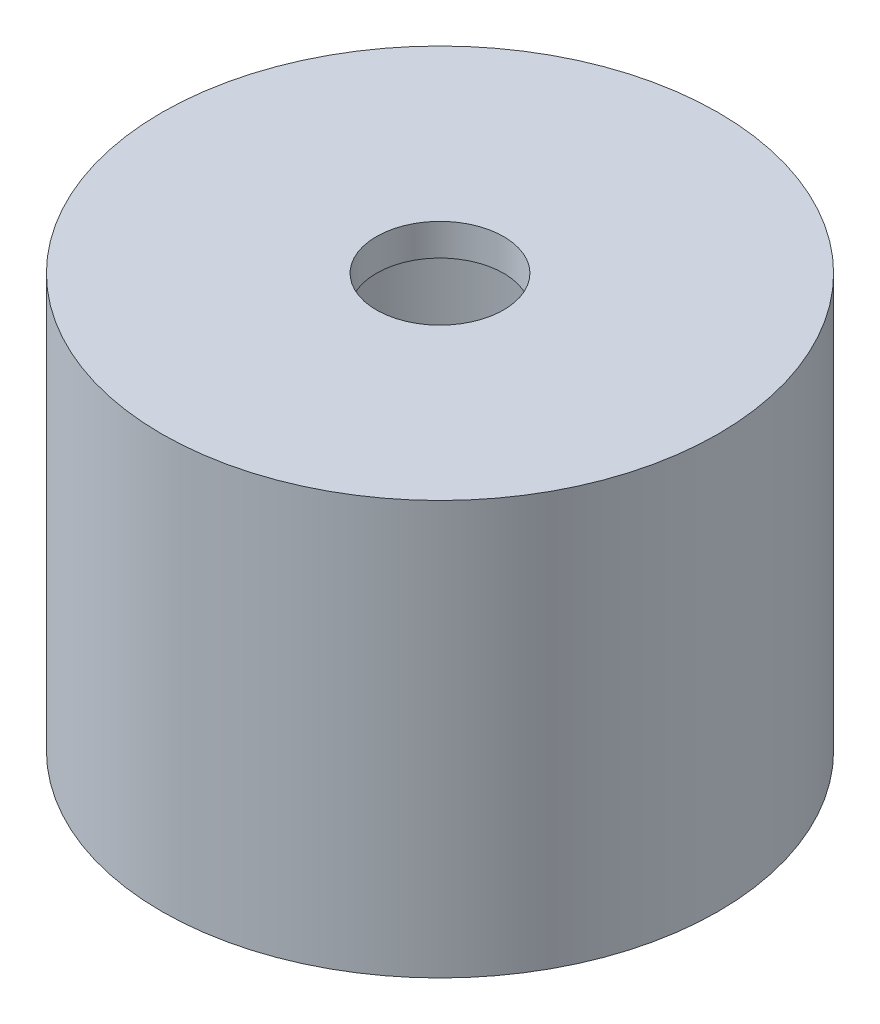
ISO-10303-21;
HEADER;
FILE_DESCRIPTION(('STEP AP214'),'2;1');
FILE_NAME('part.step','',(''),(''),'','','');
FILE_SCHEMA(('AUTOMOTIVE_DESIGN { 1 0 10303 214 1 1 1 1 }'));
ENDSEC;
DATA;
#1=APPLICATION_CONTEXT('core data for automotive mechanical design processes');
#2=APPLICATION_PROTOCOL_DEFINITION('international standard','automotive_design',2000,#1);
#3=PRODUCT_CONTEXT('',#1,'mechanical');
#4=PRODUCT('Part','Part','',(#3));
#5=PRODUCT_RELATED_PRODUCT_CATEGORY('part','',(#4));
#6=PRODUCT_DEFINITION_FORMATION('','',#4);
#7=PRODUCT_DEFINITION_CONTEXT('part definition',#1,'design');
#8=PRODUCT_DEFINITION('design','',#6,#7);
#9=PRODUCT_DEFINITION_SHAPE('','',#8);
#10=(LENGTH_UNIT() NAMED_UNIT(*) SI_UNIT(.MILLI.,.METRE.));
#11=(NAMED_UNIT(*) PLANE_ANGLE_UNIT() SI_UNIT($,.RADIAN.));
#12=(NAMED_UNIT(*) SI_UNIT($,.STERADIAN.) SOLID_ANGLE_UNIT());
#13=UNCERTAINTY_MEASURE_WITH_UNIT(LENGTH_MEASURE(1.E-05),#10,'distance_accuracy_value','');
#14=(GEOMETRIC_REPRESENTATION_CONTEXT(3) GLOBAL_UNCERTAINTY_ASSIGNED_CONTEXT((#13)) GLOBAL_UNIT_ASSIGNED_CONTEXT((#10,
#11,#12)) REPRESENTATION_CONTEXT('',''));
#15=CARTESIAN_POINT('',(0.,0.,0.));
#16=DIRECTION('',(0.,0.,1.));
#17=DIRECTION('',(1.,0.,0.));
#18=AXIS2_PLACEMENT_3D('',#15,#16,#17);
#19=CARTESIAN_POINT('',(0.,0.,0.));
#20=DIRECTION('',(0.,1.,0.));
#21=DIRECTION('',(-1.,0.,0.));
#22=AXIS2_PLACEMENT_3D('',#19,#20,#21);
#23=CYLINDRICAL_SURFACE('',#22,17.5);
#24=CARTESIAN_POINT('',(-17.3853386507137,-13.5,-2.));
#25=CARTESIAN_POINT('',(-17.3853401353315,-13.3880534106275,-1.99999519733595));
#26=CARTESIAN_POINT('',(-17.3864315751054,-13.2760350050781,-1.99056928251642));
#27=CARTESIAN_POINT('',(-17.3906782331753,-13.0551103283025,-1.95311344773096));
#28=CARTESIAN_POINT('',(-17.3938356616542,-12.946207520496,-1.92506360351944));
#29=CARTESIAN_POINT('',(-17.4018520931882,-12.7347449697205,-1.85119296589626));
#30=CARTESIAN_POINT('',(-17.4067099973959,-12.6321811807144,-1.80538364660709));
#31=CARTESIAN_POINT('',(-17.4175786814491,-12.4362179339541,-1.6973178849601));
#32=CARTESIAN_POINT('',(-17.423589249671,-12.3428167987322,-1.6350644608687));
#33=CARTESIAN_POINT('',(-17.4361176819346,-12.1673704362883,-1.49556368835386));
#34=CARTESIAN_POINT('',(-17.4426375676046,-12.0853744720842,-1.41825455823809));
#35=CARTESIAN_POINT('',(-17.4554317583341,-11.9354909775062,-1.25096954824277));
#36=CARTESIAN_POINT('',(-17.4617060516193,-11.8676041228942,-1.16099306200071));
#37=CARTESIAN_POINT('',(-17.4733225280882,-11.7476917594087,-0.970620910263634));
#38=CARTESIAN_POINT('',(-17.4786620969871,-11.6957104419626,-0.870197236204717));
#39=CARTESIAN_POINT('',(-17.4877853680334,-11.6093675939413,-0.661974973209919));
#40=CARTESIAN_POINT('',(-17.4915691188697,-11.5750055119674,-0.554176615186414));
#41=CARTESIAN_POINT('',(-17.4971402074226,-11.5250226574715,-0.334766558288023));
#42=CARTESIAN_POINT('',(-17.4989362281041,-11.5093203514256,-0.223173657194598));
#43=CARTESIAN_POINT('',(-17.5003590938998,-11.4968502785792,0.00107691382555918));
#44=CARTESIAN_POINT('',(-17.4999860111176,-11.5000818823936,0.11373454823503));
#45=CARTESIAN_POINT('',(-17.497119767547,-11.5253221727227,0.33636248784968));
#46=CARTESIAN_POINT('',(-17.4946365066491,-11.5472431795839,0.44634287900327));
#47=CARTESIAN_POINT('',(-17.487840154992,-11.6091031704963,0.661053445479786));
#48=CARTESIAN_POINT('',(-17.4835270343592,-11.6490424487068,0.765783535057301));
#49=CARTESIAN_POINT('',(-17.4735386514763,-11.7458998090241,0.967294288035754));
#50=CARTESIAN_POINT('',(-17.4678603196472,-11.8028562239929,1.06405636819045));
#51=CARTESIAN_POINT('',(-17.4557776619181,-11.9321032155566,1.24668163917683));
#52=CARTESIAN_POINT('',(-17.449373308183,-12.0043943801677,1.33254441186903));
#53=CARTESIAN_POINT('',(-17.436513040988,-12.1627508055122,1.49144815236604));
#54=CARTESIAN_POINT('',(-17.4300570420279,-12.2488924178999,1.56441304576845));
#55=CARTESIAN_POINT('',(-17.4178574111694,-12.4322411076691,1.69485961446738));
#56=CARTESIAN_POINT('',(-17.4121137808956,-12.5294482102849,1.75234125445402));
#57=CARTESIAN_POINT('',(-17.4019890438088,-12.7322320602566,1.85019181534949));
#58=CARTESIAN_POINT('',(-17.3976083716403,-12.8378114640803,1.89055527879404));
#59=CARTESIAN_POINT('',(-17.3907142897617,-13.0543105765331,1.95295957446188));
#60=CARTESIAN_POINT('',(-17.3882008052541,-13.165230071055,1.97500114064275));
#61=CARTESIAN_POINT('',(-17.3853390699854,-13.388590723993,2.00003653434785));
#62=CARTESIAN_POINT('',(-17.384978682311,-13.501019765499,2.00313713351255));
#63=CARTESIAN_POINT('',(-17.3864318824203,-13.724795725912,1.99048370024868));
#64=CARTESIAN_POINT('',(-17.3882454316329,-13.8361426639828,1.97473000234356));
#65=CARTESIAN_POINT('',(-17.3938311078367,-14.0542777104319,1.92490480743124));
#66=CARTESIAN_POINT('',(-17.3975977651037,-14.1610776535572,1.89088445720912));
#67=CARTESIAN_POINT('',(-17.4066608217964,-14.3674562088561,1.8055441206904));
#68=CARTESIAN_POINT('',(-17.4119572665405,-14.4670346069898,1.75422362188829));
#69=CARTESIAN_POINT('',(-17.4235123453982,-14.6566281200632,1.63547501760195));
#70=CARTESIAN_POINT('',(-17.4297751382952,-14.7465989128562,1.5679765587049));
#71=CARTESIAN_POINT('',(-17.442543959092,-14.9139723082586,1.41888814821184));
#72=CARTESIAN_POINT('',(-17.4490499948718,-14.991374503276,1.33729773979956));
#73=CARTESIAN_POINT('',(-17.4616092377758,-15.1317854831745,1.16187651855541));
#74=CARTESIAN_POINT('',(-17.4676601534551,-15.1947243377017,1.06798954470542));
#75=CARTESIAN_POINT('',(-17.4785935486018,-15.3039393791936,0.870915351390361));
#76=CARTESIAN_POINT('',(-17.4834760482544,-15.3502158540187,0.767728292632569));
#77=CARTESIAN_POINT('',(-17.4915122431867,-15.4246756612399,0.555220730050709));
#78=CARTESIAN_POINT('',(-17.4946698766728,-15.4529002350619,0.445914831710693));
#79=CARTESIAN_POINT('',(-17.498916830849,-15.4905894195193,0.224077216219367));
#80=CARTESIAN_POINT('',(-17.5000062287579,-15.5000547305438,0.111545619660738));
#81=CARTESIAN_POINT('',(-17.4999937520126,-15.4999451025024,-0.112864401253134));
#82=CARTESIAN_POINT('',(-17.4989043247502,-15.4904783204506,-0.22474289469505));
#83=CARTESIAN_POINT('',(-17.4946812487719,-15.4530012713425,-0.445308378800854));
#84=CARTESIAN_POINT('',(-17.4915475999627,-15.4249910034401,-0.553995369319135));
#85=CARTESIAN_POINT('',(-17.4835868311737,-15.3512542852782,-0.765084431079246));
#86=CARTESIAN_POINT('',(-17.478760120486,-15.3055321165341,-0.867488014290727));
#87=CARTESIAN_POINT('',(-17.4679493137143,-15.1976807335209,-1.0631853726956));
#88=CARTESIAN_POINT('',(-17.4619652131149,-15.1355514552428,-1.15647911234695));
#89=CARTESIAN_POINT('',(-17.4494678477128,-14.9962464882111,-1.33186210611053));
#90=CARTESIAN_POINT('',(-17.4429518630308,-14.9189902181949,-1.41388716420689));
#91=CARTESIAN_POINT('',(-17.4301475365176,-14.7517890168144,-1.5638533009412));
#92=CARTESIAN_POINT('',(-17.4238592492669,-14.6618410681513,-1.63179102096622));
#93=CARTESIAN_POINT('',(-17.4122005213082,-14.4714803763493,-1.75183717616198));
#94=CARTESIAN_POINT('',(-17.4068331273112,-14.3710346006377,-1.80389349456594));
#95=CARTESIAN_POINT('',(-17.3976597913728,-14.1628256626319,-1.89032803888977));
#96=CARTESIAN_POINT('',(-17.3938521233529,-14.0550707438652,-1.92472581745879));
#97=CARTESIAN_POINT('',(-17.3891702575432,-13.8722778731211,-1.96647476380521));
#98=CARTESIAN_POINT('',(-17.3877403947785,-13.7984004548313,-1.9790290620281));
#99=CARTESIAN_POINT('',(-17.3858240977585,-13.6496927260883,-1.99579326119775));
#100=CARTESIAN_POINT('',(-17.3853376579002,-13.574862421297,-2.00000321170177));
#101=CARTESIAN_POINT('',(-17.3853386507137,-13.5,-2.));
#102=B_SPLINE_CURVE_WITH_KNOTS('',3,(#24,#25,#26,#27,#28,#29,#30,#31,#32,#33,#34,#35,#36,#37,
#38,#39,#40,#41,#42,#43,#44,#45,#46,#47,#48,#49,#50,#51,#52,#53,#54,#55,#56,#57,#58,#59,#60,#61,
#62,#63,#64,#65,#66,#67,#68,#69,#70,#71,#72,#73,#74,#75,#76,#77,#78,#79,#80,#81,#82,#83,#84,#85,
#86,#87,#88,#89,#90,#91,#92,#93,#94,#95,#96,#97,#98,#99,#100,#101),.UNSPECIFIED.,.T.,.F.,(4,2,2,
2,2,2,2,2,2,2,2,2,2,2,2,2,2,2,2,2,2,2,2,2,2,2,2,2,2,2,2,2,2,2,2,2,2,2,4),(0.,0.335566330669862,
0.671492236482426,1.00720146648589,1.34284912082551,1.67990430025881,2.01697561937899,
2.35497511648652,2.69296403516427,3.02947062308711,3.36596602520247,3.70089142156129,
4.03582228598058,4.3715133792636,4.70721734706225,5.04483970261994,5.3824628281258,
5.72019351085555,6.05791066376697,6.39372230997641,6.72952799811684,7.06439829362763,
7.3992785103225,7.73564232927687,8.07201705412561,8.40998545131677,8.74794800946722,
9.08513567305447,9.42231074728433,9.75756507912587,10.0928194262631,10.4279927825518,
10.7631674464669,11.1001786972192,11.4372702038874,11.7754563049136,12.113267132881,
12.3376728727777,12.5620772799195),.UNSPECIFIED.);
#103=CARTESIAN_POINT('',(-17.3853386507137,-13.5,-2.));
#104=VERTEX_POINT('',#103);
#105=EDGE_CURVE('E54',#104,#104,#102,.T.);
#106=ORIENTED_EDGE('',*,*,#105,.T.);
#107=EDGE_LOOP('',(#106));
#108=FACE_BOUND('',#107,.T.);
#109=CARTESIAN_POINT('',(0.,-21.,0.));
#110=DIRECTION('',(0.,1.,0.));
#111=DIRECTION('',(-1.,0.,0.));
#112=AXIS2_PLACEMENT_3D('',#109,#110,#111);
#113=CIRCLE('',#112,17.5);
#114=CARTESIAN_POINT('',(-17.5,-21.,0.));
#115=VERTEX_POINT('',#114);
#116=EDGE_CURVE('E10',#115,#115,#113,.T.);
#117=ORIENTED_EDGE('',*,*,#116,.T.);
#118=EDGE_LOOP('',(#117));
#119=FACE_BOUND('',#118,.T.);
#120=CARTESIAN_POINT('',(0.,4.99999999999999,0.));
#121=DIRECTION('',(0.,1.,0.));
#122=DIRECTION('',(-1.,0.,0.));
#123=AXIS2_PLACEMENT_3D('',#120,#121,#122);
#124=CIRCLE('',#123,17.5);
#125=CARTESIAN_POINT('',(-17.5,4.99999999999999,0.));
#126=VERTEX_POINT('',#125);
#127=EDGE_CURVE('E51',#126,#126,#124,.T.);
#128=ORIENTED_EDGE('',*,*,#127,.F.);
#129=EDGE_LOOP('',(#128));
#130=FACE_BOUND('',#129,.T.);
#131=ADVANCED_FACE('F29',(#108,#119,#130),#23,.T.);
#132=CARTESIAN_POINT('',(-17.5,-21.,0.));
#133=DIRECTION('',(0.,-1.,0.));
#134=DIRECTION('',(1.,0.,0.));
#135=AXIS2_PLACEMENT_3D('',#132,#133,#134);
#136=PLANE('',#135);
#137=CARTESIAN_POINT('',(0.,-21.,0.));
#138=DIRECTION('',(0.,1.,0.));
#139=DIRECTION('',(-1.,0.,0.));
#140=AXIS2_PLACEMENT_3D('',#137,#138,#139);
#141=CIRCLE('',#140,11.);
#142=CARTESIAN_POINT('',(-11.,-21.,0.));
#143=VERTEX_POINT('',#142);
#144=EDGE_CURVE('E35',#143,#143,#141,.T.);
#145=ORIENTED_EDGE('',*,*,#144,.T.);
#146=EDGE_LOOP('',(#145));
#147=FACE_BOUND('',#146,.T.);
#148=ORIENTED_EDGE('',*,*,#116,.F.);
#149=EDGE_LOOP('',(#148));
#150=FACE_BOUND('',#149,.T.);
#151=ADVANCED_FACE('F87',(#147,#150),#136,.T.);
#152=CARTESIAN_POINT('',(0.,0.,0.));
#153=DIRECTION('',(0.,1.,0.));
#154=DIRECTION('',(-1.,0.,0.));
#155=AXIS2_PLACEMENT_3D('',#152,#153,#154);
#156=CYLINDRICAL_SURFACE('',#155,11.);
#157=CARTESIAN_POINT('',(-10.816653826392,-13.5,-2.));
#158=CARTESIAN_POINT('',(-10.8166559469823,-13.611340122573,-1.99999566748834));
#159=CARTESIAN_POINT('',(-10.818391586416,-13.722737191288,-1.9906710042305));
#160=CARTESIAN_POINT('',(-10.825138630904,-13.942394615873,-1.953641319662));
#161=CARTESIAN_POINT('',(-10.8301528833982,-14.0506521596693,-1.92592032102069));
#162=CARTESIAN_POINT('',(-10.8428709030557,-14.2608203130185,-1.85297369289719));
#163=CARTESIAN_POINT('',(-10.8505722376174,-14.3627365653081,-1.80776389192774));
#164=CARTESIAN_POINT('',(-10.8677937983011,-14.557529891629,-1.70116425408316));
#165=CARTESIAN_POINT('',(-10.8773138647657,-14.6504077580164,-1.6397758372698));
#166=CARTESIAN_POINT('',(-10.8972247379328,-14.8255834474418,-1.50179524823966));
#167=CARTESIAN_POINT('',(-10.9076236306456,-14.907760074234,-1.42505035347811));
#168=CARTESIAN_POINT('',(-10.9280489317643,-15.0581455628344,-1.25886539634162));
#169=CARTESIAN_POINT('',(-10.9380753163763,-15.1263535336454,-1.1694245247635));
#170=CARTESIAN_POINT('',(-10.9567122399244,-15.2473273184502,-0.979593418999865));
#171=CARTESIAN_POINT('',(-10.965312146403,-15.2999792699958,-0.879129490479886));
#172=CARTESIAN_POINT('',(-10.9800367733651,-15.3876133330262,-0.670599774437608));
#173=CARTESIAN_POINT('',(-10.98616168519,-15.4225968105094,-0.562534575326678));
#174=CARTESIAN_POINT('',(-10.9951891058833,-15.4735272332555,-0.343124837820857));
#175=CARTESIAN_POINT('',(-10.9981261454525,-15.4896783143207,-0.231829128518767));
#176=CARTESIAN_POINT('',(-11.0005658088946,-15.5031211674624,-0.00807147296592421));
#177=CARTESIAN_POINT('',(-11.0000687084839,-15.5004144535716,0.104390378935039));
#178=CARTESIAN_POINT('',(-10.9957231855211,-15.4763758579221,0.325889196140741));
#179=CARTESIAN_POINT('',(-10.9919143087691,-15.4552637464856,0.43495090005335));
#180=CARTESIAN_POINT('',(-10.9814174690798,-15.3953608025385,0.647957490603366));
#181=CARTESIAN_POINT('',(-10.974729405919,-15.3565693546138,0.751902198979603));
#182=CARTESIAN_POINT('',(-10.9591592037236,-15.2621969402209,0.952366225453847));
#183=CARTESIAN_POINT('',(-10.9502655302338,-15.2065273559662,1.04884289251747));
#184=CARTESIAN_POINT('',(-10.9312689682172,-15.0800441100753,1.23116763357293));
#185=CARTESIAN_POINT('',(-10.9211659638428,-15.0092289970645,1.31701468769822));
#186=CARTESIAN_POINT('',(-10.9006990809284,-14.8532515454207,1.47694445054395));
#187=CARTESIAN_POINT('',(-10.8903335415211,-14.767896982081,1.55083959404949));
#188=CARTESIAN_POINT('',(-10.8706496206858,-14.5859059360791,1.68329271964166));
#189=CARTESIAN_POINT('',(-10.861331252829,-14.4892693072348,1.74185050296967));
#190=CARTESIAN_POINT('',(-10.8447947340983,-14.2872174895132,1.84201538249092));
#191=CARTESIAN_POINT('',(-10.8375798001274,-14.1817891683602,1.88359655385222));
#192=CARTESIAN_POINT('',(-10.8261173347694,-13.9652825501116,1.94840376886998));
#193=CARTESIAN_POINT('',(-10.8218694887144,-13.8542048534889,1.97163175896676));
#194=CARTESIAN_POINT('',(-10.8168840409274,-13.6312401987946,1.99880217851546));
#195=CARTESIAN_POINT('',(-10.8160975038278,-13.5193870673304,2.00301348489165));
#196=CARTESIAN_POINT('',(-10.8179929515389,-13.2965754494389,1.9927505477885));
#197=CARTESIAN_POINT('',(-10.8206747755886,-13.1856169217861,1.97827717035788));
#198=CARTESIAN_POINT('',(-10.8291592937867,-12.9686196559477,1.93128609638897));
#199=CARTESIAN_POINT('',(-10.8349378000789,-12.862549615992,1.89890818855376));
#200=CARTESIAN_POINT('',(-10.8489439080076,-12.6573402811716,1.81717497571878));
#201=CARTESIAN_POINT('',(-10.8571716806773,-12.5582014709143,1.76781848506108));
#202=CARTESIAN_POINT('',(-10.8752613415266,-12.3684808039848,1.65290586187994));
#203=CARTESIAN_POINT('',(-10.8851400484298,-12.2780038819156,1.58717917941566));
#204=CARTESIAN_POINT('',(-10.9053706629202,-12.1092663084023,1.44162304950736));
#205=CARTESIAN_POINT('',(-10.91572261035,-12.0310066880004,1.36179241301324));
#206=CARTESIAN_POINT('',(-10.9358898604531,-11.8879271538502,1.18909630007261));
#207=CARTESIAN_POINT('',(-10.9456968282676,-11.8232876446382,1.09608023252376));
#208=CARTESIAN_POINT('',(-10.9635308137777,-11.710553693917,0.900352619793526));
#209=CARTESIAN_POINT('',(-10.9715578970606,-11.6624586427228,0.797641432067846));
#210=CARTESIAN_POINT('',(-10.9848917263157,-11.5844519613636,0.585948218345342));
#211=CARTESIAN_POINT('',(-10.9902119510479,-11.5544500951235,0.47700032935395));
#212=CARTESIAN_POINT('',(-10.9975899747809,-11.5131926567029,0.255506648963479));
#213=CARTESIAN_POINT('',(-10.9996480956777,-11.5019352348633,0.14296121367923));
#214=CARTESIAN_POINT('',(-11.0002641421388,-11.4985474788945,-0.0807996190288181));
#215=CARTESIAN_POINT('',(-10.9988720323112,-11.5061441115153,-0.192010837925449));
#216=CARTESIAN_POINT('',(-10.9928473390214,-11.539652946424,-0.411544538990868));
#217=CARTESIAN_POINT('',(-10.9882147827193,-11.565564995199,-0.519867045363828));
#218=CARTESIAN_POINT('',(-10.9762290690773,-11.6348569034893,-0.730415433440432));
#219=CARTESIAN_POINT('',(-10.96888018348,-11.6782093453756,-0.8326505966462));
#220=CARTESIAN_POINT('',(-10.9522592239203,-11.7811194028088,-1.02843701194217));
#221=CARTESIAN_POINT('',(-10.9429870315355,-11.8406780162774,-1.12198772879735));
#222=CARTESIAN_POINT('',(-10.9233859020729,-11.9752576385619,-1.29911459753549));
#223=CARTESIAN_POINT('',(-10.9130443794735,-12.0504766953843,-1.38253889858449));
#224=CARTESIAN_POINT('',(-10.8925517029222,-12.2138295166935,-1.53567622355086));
#225=CARTESIAN_POINT('',(-10.8824005942262,-12.3019663085616,-1.60538602436339));
#226=CARTESIAN_POINT('',(-10.8633428283932,-12.4895596756011,-1.72967671803608));
#227=CARTESIAN_POINT('',(-10.8544476470463,-12.5891072393114,-1.78412208501856));
#228=CARTESIAN_POINT('',(-10.8390461745677,-12.796063276726,-1.87543058906983));
#229=CARTESIAN_POINT('',(-10.8325375922296,-12.9034640916078,-1.9123105996278));
#230=CARTESIAN_POINT('',(-10.8240281075057,-13.0926766844323,-1.95979896205519));
#231=CARTESIAN_POINT('',(-10.821278872104,-13.1733692626086,-1.97484899189766));
#232=CARTESIAN_POINT('',(-10.8175909727573,-13.3360309520322,-1.99495098425024));
#233=CARTESIAN_POINT('',(-10.8166522646159,-13.4180000320697,-2.00000319081575));
#234=CARTESIAN_POINT('',(-10.816653826392,-13.5,-2.));
#235=B_SPLINE_CURVE_WITH_KNOTS('',3,(#157,#158,#159,#160,#161,#162,#163,#164,#165,#166,#167,
#168,#169,#170,#171,#172,#173,#174,#175,#176,#177,#178,#179,#180,#181,#182,#183,#184,#185,#186,
#187,#188,#189,#190,#191,#192,#193,#194,#195,#196,#197,#198,#199,#200,#201,#202,#203,#204,#205,
#206,#207,#208,#209,#210,#211,#212,#213,#214,#215,#216,#217,#218,#219,#220,#221,#222,#223,#224,
#225,#226,#227,#228,#229,#230,#231,#232,#233,#234),.UNSPECIFIED.,.T.,.F.,(4,2,2,2,2,2,2,2,2,2,2,
2,2,2,2,2,2,2,2,2,2,2,2,2,2,2,2,2,2,2,2,2,2,2,2,2,2,2,4),(0.,0.333720352628772,
0.667730923425362,1.00143989738151,1.33511959011685,1.6722993511526,2.00950061266478,
2.34911212511978,2.6886973772514,3.02456639415963,3.3604084455173,3.69229445292967,
4.02419201411038,4.3578632848798,4.69156654523441,5.03008350848145,5.36860485839155,
5.70764124486732,6.04664167012788,6.38083364646979,6.71501013332593,7.04661365662177,
7.37824034134339,7.71347820234125,8.04874433945132,8.38820522569594,8.72765360102077,
9.06539473675368,9.40310254298626,9.73594847886932,10.0687916249998,10.4011135484041,
10.7334559397116,11.0702887970716,11.4072007206838,11.7470154829573,12.0865031534681,
12.3322881015162,12.5780670496697),.UNSPECIFIED.);
#236=CARTESIAN_POINT('',(-10.816653826392,-13.5,-2.));
#237=VERTEX_POINT('',#236);
#238=EDGE_CURVE('E61',#237,#237,#235,.T.);
#239=ORIENTED_EDGE('',*,*,#238,.T.);
#240=EDGE_LOOP('',(#239));
#241=FACE_BOUND('',#240,.T.);
#242=CARTESIAN_POINT('',(0.,2.99999999999999,0.));
#243=DIRECTION('',(0.,1.,0.));
#244=DIRECTION('',(-1.,0.,0.));
#245=AXIS2_PLACEMENT_3D('',#242,#243,#244);
#246=CIRCLE('',#245,11.);
#247=CARTESIAN_POINT('',(-11.,2.99999999999998,0.));
#248=VERTEX_POINT('',#247);
#249=EDGE_CURVE('E39',#248,#248,#246,.T.);
#250=ORIENTED_EDGE('',*,*,#249,.T.);
#251=EDGE_LOOP('',(#250));
#252=FACE_BOUND('',#251,.T.);
#253=ORIENTED_EDGE('',*,*,#144,.F.);
#254=EDGE_LOOP('',(#253));
#255=FACE_BOUND('',#254,.T.);
#256=ADVANCED_FACE('F84',(#241,#252,#255),#156,.F.);
#257=CARTESIAN_POINT('',(-11.,2.99999999999998,0.));
#258=DIRECTION('',(0.,-1.,0.));
#259=DIRECTION('',(1.,0.,0.));
#260=AXIS2_PLACEMENT_3D('',#257,#258,#259);
#261=PLANE('',#260);
#262=CARTESIAN_POINT('',(0.,2.99999999999998,0.));
#263=DIRECTION('',(0.,1.,0.));
#264=DIRECTION('',(-1.,0.,0.));
#265=AXIS2_PLACEMENT_3D('',#262,#263,#264);
#266=CIRCLE('',#265,4.);
#267=CARTESIAN_POINT('',(-4.,2.99999999999998,0.));
#268=VERTEX_POINT('',#267);
#269=EDGE_CURVE('E43',#268,#268,#266,.T.);
#270=ORIENTED_EDGE('',*,*,#269,.T.);
#271=EDGE_LOOP('',(#270));
#272=FACE_BOUND('',#271,.T.);
#273=ORIENTED_EDGE('',*,*,#249,.F.);
#274=EDGE_LOOP('',(#273));
#275=FACE_BOUND('',#274,.T.);
#276=ADVANCED_FACE('F80',(#272,#275),#261,.T.);
#277=CARTESIAN_POINT('',(0.,0.,0.));
#278=DIRECTION('',(0.,1.,0.));
#279=DIRECTION('',(-1.,0.,0.));
#280=AXIS2_PLACEMENT_3D('',#277,#278,#279);
#281=CYLINDRICAL_SURFACE('',#280,4.);
#282=CARTESIAN_POINT('',(0.,4.99999999999999,0.));
#283=DIRECTION('',(0.,1.,0.));
#284=DIRECTION('',(-1.,0.,0.));
#285=AXIS2_PLACEMENT_3D('',#282,#283,#284);
#286=CIRCLE('',#285,4.);
#287=CARTESIAN_POINT('',(-4.,4.99999999999999,0.));
#288=VERTEX_POINT('',#287);
#289=EDGE_CURVE('E48',#288,#288,#286,.T.);
#290=ORIENTED_EDGE('',*,*,#289,.T.);
#291=EDGE_LOOP('',(#290));
#292=FACE_BOUND('',#291,.T.);
#293=ORIENTED_EDGE('',*,*,#269,.F.);
#294=EDGE_LOOP('',(#293));
#295=FACE_BOUND('',#294,.T.);
#296=ADVANCED_FACE('F76',(#292,#295),#281,.F.);
#297=CARTESIAN_POINT('',(-17.5,4.99999999999999,0.));
#298=DIRECTION('',(0.,1.,0.));
#299=DIRECTION('',(-1.,0.,0.));
#300=AXIS2_PLACEMENT_3D('',#297,#298,#299);
#301=PLANE('',#300);
#302=ORIENTED_EDGE('',*,*,#127,.T.);
#303=EDGE_LOOP('',(#302));
#304=FACE_BOUND('',#303,.T.);
#305=ORIENTED_EDGE('',*,*,#289,.F.);
#306=EDGE_LOOP('',(#305));
#307=FACE_BOUND('',#306,.T.);
#308=ADVANCED_FACE('F71',(#304,#307),#301,.T.);
#309=CARTESIAN_POINT('',(-17.501,-13.5,0.));
#310=DIRECTION('',(1.,0.,0.));
#311=DIRECTION('',(0.,0.,-1.));
#312=AXIS2_PLACEMENT_3D('',#309,#310,#311);
#313=CYLINDRICAL_SURFACE('',#312,2.);
#314=ORIENTED_EDGE('',*,*,#105,.F.);
#315=EDGE_LOOP('',(#314));
#316=FACE_BOUND('',#315,.T.);
#317=ORIENTED_EDGE('',*,*,#238,.F.);
#318=EDGE_LOOP('',(#317));
#319=FACE_BOUND('',#318,.T.);
#320=ADVANCED_FACE('F65',(#316,#319),#313,.F.);
#321=CLOSED_SHELL('',(#131,#151,#256,#276,#296,#308,#320));
#322=MANIFOLD_SOLID_BREP('B2',#321);
#323=ADVANCED_BREP_SHAPE_REPRESENTATION('',(#18,#322),#14);
#324=SHAPE_DEFINITION_REPRESENTATION(#9,#323);
ENDSEC;
END-ISO-10303-21;
